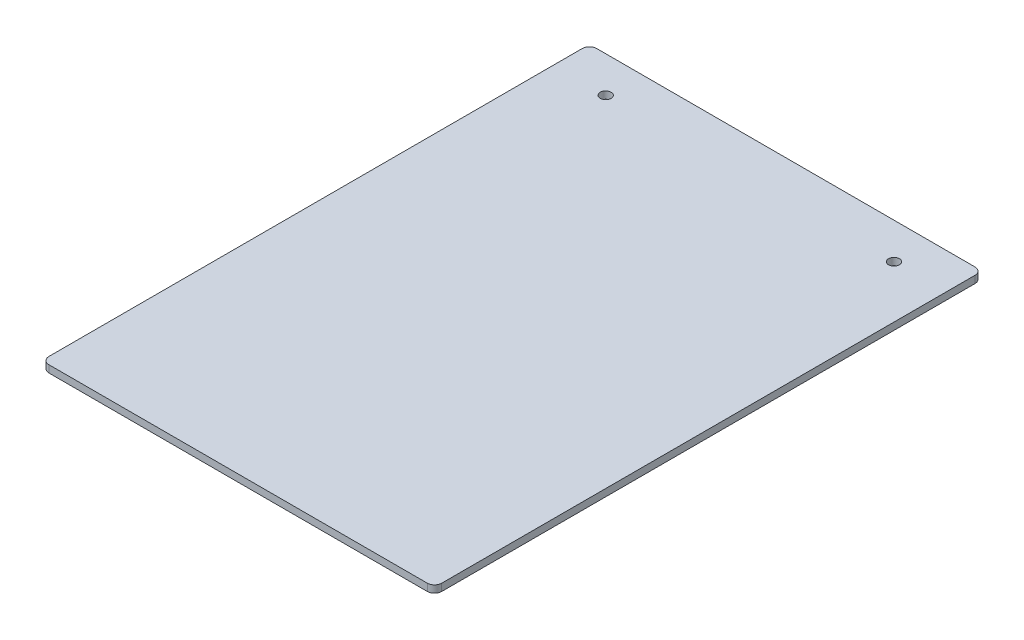
ISO-10303-21;
HEADER;
FILE_DESCRIPTION(('STEP AP214'),'2;1');
FILE_NAME('part.step','',(''),(''),'','','');
FILE_SCHEMA(('AUTOMOTIVE_DESIGN { 1 0 10303 214 1 1 1 1 }'));
ENDSEC;
DATA;
#1=APPLICATION_CONTEXT('core data for automotive mechanical design processes');
#2=APPLICATION_PROTOCOL_DEFINITION('international standard','automotive_design',2000,#1);
#3=PRODUCT_CONTEXT('',#1,'mechanical');
#4=PRODUCT('Part','Part','',(#3));
#5=PRODUCT_RELATED_PRODUCT_CATEGORY('part','',(#4));
#6=PRODUCT_DEFINITION_FORMATION('','',#4);
#7=PRODUCT_DEFINITION_CONTEXT('part definition',#1,'design');
#8=PRODUCT_DEFINITION('design','',#6,#7);
#9=PRODUCT_DEFINITION_SHAPE('','',#8);
#10=(LENGTH_UNIT() NAMED_UNIT(*) SI_UNIT(.MILLI.,.METRE.));
#11=(NAMED_UNIT(*) PLANE_ANGLE_UNIT() SI_UNIT($,.RADIAN.));
#12=(NAMED_UNIT(*) SI_UNIT($,.STERADIAN.) SOLID_ANGLE_UNIT());
#13=UNCERTAINTY_MEASURE_WITH_UNIT(LENGTH_MEASURE(1.E-05),#10,'distance_accuracy_value','');
#14=(GEOMETRIC_REPRESENTATION_CONTEXT(3) GLOBAL_UNCERTAINTY_ASSIGNED_CONTEXT((#13)) GLOBAL_UNIT_ASSIGNED_CONTEXT((#10,
#11,#12)) REPRESENTATION_CONTEXT('',''));
#15=CARTESIAN_POINT('',(0.,0.,0.));
#16=DIRECTION('',(0.,0.,1.));
#17=DIRECTION('',(1.,0.,0.));
#18=AXIS2_PLACEMENT_3D('',#15,#16,#17);
#19=CARTESIAN_POINT('',(173.0375,6.35,241.3));
#20=DIRECTION('',(-1.,0.,0.));
#21=DIRECTION('',(0.,0.,1.));
#22=AXIS2_PLACEMENT_3D('',#19,#20,#21);
#23=PLANE('',#22);
#24=DIRECTION('',(0.,0.,-1.));
#25=VECTOR('',#24,1.);
#26=CARTESIAN_POINT('',(173.0375,0.,241.3));
#27=LINE('',#26,#25);
#28=CARTESIAN_POINT('',(173.0375,0.,234.95));
#29=VERTEX_POINT('',#28);
#30=CARTESIAN_POINT('',(173.0375,0.,-234.95));
#31=VERTEX_POINT('',#30);
#32=EDGE_CURVE('E127',#29,#31,#27,.T.);
#33=ORIENTED_EDGE('',*,*,#32,.T.);
#34=DIRECTION('',(0.,-1.,0.));
#35=VECTOR('',#34,1.);
#36=CARTESIAN_POINT('',(173.0375,6.35,-234.95));
#37=LINE('',#36,#35);
#38=CARTESIAN_POINT('',(173.0375,6.35,-234.95));
#39=VERTEX_POINT('',#38);
#40=EDGE_CURVE('E105',#31,#39,#37,.F.);
#41=ORIENTED_EDGE('',*,*,#40,.T.);
#42=DIRECTION('',(0.,0.,-1.));
#43=VECTOR('',#42,1.);
#44=CARTESIAN_POINT('',(173.0375,6.35,241.3));
#45=LINE('',#44,#43);
#46=CARTESIAN_POINT('',(173.0375,6.35,234.95));
#47=VERTEX_POINT('',#46);
#48=EDGE_CURVE('E137',#47,#39,#45,.T.);
#49=ORIENTED_EDGE('',*,*,#48,.F.);
#50=DIRECTION('',(0.,-1.,0.));
#51=VECTOR('',#50,1.);
#52=CARTESIAN_POINT('',(173.0375,6.35,234.95));
#53=LINE('',#52,#51);
#54=EDGE_CURVE('E110',#47,#29,#53,.T.);
#55=ORIENTED_EDGE('',*,*,#54,.T.);
#56=EDGE_LOOP('',(#33,#41,#49,#55));
#57=FACE_BOUND('',#56,.T.);
#58=ADVANCED_FACE('F34',(#57),#23,.F.);
#59=CARTESIAN_POINT('',(-173.0375,6.35,-241.3));
#60=DIRECTION('',(0.,0.,1.));
#61=DIRECTION('',(1.,0.,0.));
#62=AXIS2_PLACEMENT_3D('',#59,#60,#61);
#63=PLANE('',#62);
#64=DIRECTION('',(-1.,0.,0.));
#65=VECTOR('',#64,1.);
#66=CARTESIAN_POINT('',(-173.0375,6.35,-241.3));
#67=LINE('',#66,#65);
#68=CARTESIAN_POINT('',(166.6875,6.35,-241.3));
#69=VERTEX_POINT('',#68);
#70=CARTESIAN_POINT('',(-166.6875,6.35,-241.3));
#71=VERTEX_POINT('',#70);
#72=EDGE_CURVE('E120',#69,#71,#67,.T.);
#73=ORIENTED_EDGE('',*,*,#72,.F.);
#74=DIRECTION('',(0.,-1.,0.));
#75=VECTOR('',#74,1.);
#76=CARTESIAN_POINT('',(166.6875,6.35,-241.3));
#77=LINE('',#76,#75);
#78=CARTESIAN_POINT('',(166.6875,0.,-241.3));
#79=VERTEX_POINT('',#78);
#80=EDGE_CURVE('E104',#69,#79,#77,.T.);
#81=ORIENTED_EDGE('',*,*,#80,.T.);
#82=DIRECTION('',(-1.,0.,0.));
#83=VECTOR('',#82,1.);
#84=CARTESIAN_POINT('',(-173.0375,0.,-241.3));
#85=LINE('',#84,#83);
#86=CARTESIAN_POINT('',(-166.6875,0.,-241.3));
#87=VERTEX_POINT('',#86);
#88=EDGE_CURVE('E117',#79,#87,#85,.T.);
#89=ORIENTED_EDGE('',*,*,#88,.T.);
#90=DIRECTION('',(0.,-1.,0.));
#91=VECTOR('',#90,1.);
#92=CARTESIAN_POINT('',(-166.6875,6.35,-241.3));
#93=LINE('',#92,#91);
#94=EDGE_CURVE('E122',#87,#71,#93,.F.);
#95=ORIENTED_EDGE('',*,*,#94,.T.);
#96=EDGE_LOOP('',(#73,#81,#89,#95));
#97=FACE_BOUND('',#96,.T.);
#98=ADVANCED_FACE('F116',(#97),#63,.F.);
#99=CARTESIAN_POINT('',(-173.0375,6.35,241.3));
#100=DIRECTION('',(1.,0.,0.));
#101=DIRECTION('',(0.,0.,-1.));
#102=AXIS2_PLACEMENT_3D('',#99,#100,#101);
#103=PLANE('',#102);
#104=DIRECTION('',(0.,0.,1.));
#105=VECTOR('',#104,1.);
#106=CARTESIAN_POINT('',(-173.0375,6.35,241.3));
#107=LINE('',#106,#105);
#108=CARTESIAN_POINT('',(-173.0375,6.35,-234.95));
#109=VERTEX_POINT('',#108);
#110=CARTESIAN_POINT('',(-173.0375,6.35,234.95));
#111=VERTEX_POINT('',#110);
#112=EDGE_CURVE('E163',#109,#111,#107,.T.);
#113=ORIENTED_EDGE('',*,*,#112,.F.);
#114=DIRECTION('',(0.,-1.,0.));
#115=VECTOR('',#114,1.);
#116=CARTESIAN_POINT('',(-173.0375,6.35,-234.95));
#117=LINE('',#116,#115);
#118=CARTESIAN_POINT('',(-173.0375,0.,-234.95));
#119=VERTEX_POINT('',#118);
#120=EDGE_CURVE('E156',#109,#119,#117,.T.);
#121=ORIENTED_EDGE('',*,*,#120,.T.);
#122=DIRECTION('',(0.,0.,1.));
#123=VECTOR('',#122,1.);
#124=CARTESIAN_POINT('',(-173.0375,0.,241.3));
#125=LINE('',#124,#123);
#126=CARTESIAN_POINT('',(-173.0375,0.,234.95));
#127=VERTEX_POINT('',#126);
#128=EDGE_CURVE('E126',#119,#127,#125,.T.);
#129=ORIENTED_EDGE('',*,*,#128,.T.);
#130=DIRECTION('',(0.,-1.,0.));
#131=VECTOR('',#130,1.);
#132=CARTESIAN_POINT('',(-173.0375,6.35,234.95));
#133=LINE('',#132,#131);
#134=EDGE_CURVE('E154',#127,#111,#133,.F.);
#135=ORIENTED_EDGE('',*,*,#134,.T.);
#136=EDGE_LOOP('',(#113,#121,#129,#135));
#137=FACE_BOUND('',#136,.T.);
#138=ADVANCED_FACE('F161',(#137),#103,.F.);
#139=CARTESIAN_POINT('',(-173.0375,6.35,241.3));
#140=DIRECTION('',(0.,0.,-1.));
#141=DIRECTION('',(-1.,0.,0.));
#142=AXIS2_PLACEMENT_3D('',#139,#140,#141);
#143=PLANE('',#142);
#144=DIRECTION('',(1.,0.,0.));
#145=VECTOR('',#144,1.);
#146=CARTESIAN_POINT('',(-173.0375,6.35,241.3));
#147=LINE('',#146,#145);
#148=CARTESIAN_POINT('',(-166.6875,6.35,241.3));
#149=VERTEX_POINT('',#148);
#150=CARTESIAN_POINT('',(166.6875,6.35,241.3));
#151=VERTEX_POINT('',#150);
#152=EDGE_CURVE('E138',#149,#151,#147,.T.);
#153=ORIENTED_EDGE('',*,*,#152,.F.);
#154=DIRECTION('',(0.,-1.,0.));
#155=VECTOR('',#154,1.);
#156=CARTESIAN_POINT('',(-166.6875,6.35,241.3));
#157=LINE('',#156,#155);
#158=CARTESIAN_POINT('',(-166.6875,0.,241.3));
#159=VERTEX_POINT('',#158);
#160=EDGE_CURVE('E11',#149,#159,#157,.T.);
#161=ORIENTED_EDGE('',*,*,#160,.T.);
#162=DIRECTION('',(1.,0.,0.));
#163=VECTOR('',#162,1.);
#164=CARTESIAN_POINT('',(-173.0375,0.,241.3));
#165=LINE('',#164,#163);
#166=CARTESIAN_POINT('',(166.6875,0.,241.3));
#167=VERTEX_POINT('',#166);
#168=EDGE_CURVE('E130',#159,#167,#165,.T.);
#169=ORIENTED_EDGE('',*,*,#168,.T.);
#170=DIRECTION('',(0.,-1.,0.));
#171=VECTOR('',#170,1.);
#172=CARTESIAN_POINT('',(166.6875,6.35,241.3));
#173=LINE('',#172,#171);
#174=EDGE_CURVE('E42',#167,#151,#173,.F.);
#175=ORIENTED_EDGE('',*,*,#174,.T.);
#176=EDGE_LOOP('',(#153,#161,#169,#175));
#177=FACE_BOUND('',#176,.T.);
#178=ADVANCED_FACE('F170',(#177),#143,.F.);
#179=CARTESIAN_POINT('',(0.,6.35,0.));
#180=DIRECTION('',(0.,-1.,0.));
#181=DIRECTION('',(0.,0.,-1.));
#182=AXIS2_PLACEMENT_3D('',#179,#180,#181);
#183=PLANE('',#182);
#184=CARTESIAN_POINT('',(-127.,6.35,-209.55));
#185=DIRECTION('',(0.,1.,0.));
#186=DIRECTION('',(0.,0.,1.));
#187=AXIS2_PLACEMENT_3D('',#184,#185,#186);
#188=CIRCLE('',#187,4.76249999999999);
#189=CARTESIAN_POINT('',(-127.,6.35,-204.7875));
#190=VERTEX_POINT('',#189);
#191=EDGE_CURVE('E185',#190,#190,#188,.T.);
#192=ORIENTED_EDGE('',*,*,#191,.F.);
#193=EDGE_LOOP('',(#192));
#194=FACE_BOUND('',#193,.T.);
#195=CARTESIAN_POINT('',(127.,6.35,-209.55));
#196=DIRECTION('',(0.,1.,0.));
#197=DIRECTION('',(0.,0.,1.));
#198=AXIS2_PLACEMENT_3D('',#195,#196,#197);
#199=CIRCLE('',#198,4.7625);
#200=CARTESIAN_POINT('',(127.,6.35,-204.7875));
#201=VERTEX_POINT('',#200);
#202=EDGE_CURVE('E179',#201,#201,#199,.T.);
#203=ORIENTED_EDGE('',*,*,#202,.F.);
#204=EDGE_LOOP('',(#203));
#205=FACE_BOUND('',#204,.T.);
#206=ORIENTED_EDGE('',*,*,#48,.T.);
#207=CARTESIAN_POINT('',(166.6875,6.35,-234.95));
#208=DIRECTION('',(0.,-1.,0.));
#209=DIRECTION('',(0.,0.,-1.));
#210=AXIS2_PLACEMENT_3D('',#207,#208,#209);
#211=CIRCLE('',#210,6.35);
#212=EDGE_CURVE('E152',#39,#69,#211,.F.);
#213=ORIENTED_EDGE('',*,*,#212,.T.);
#214=ORIENTED_EDGE('',*,*,#72,.T.);
#215=CARTESIAN_POINT('',(-166.6875,6.35,-234.95));
#216=DIRECTION('',(0.,-1.,0.));
#217=DIRECTION('',(0.,0.,-1.));
#218=AXIS2_PLACEMENT_3D('',#215,#216,#217);
#219=CIRCLE('',#218,6.35);
#220=EDGE_CURVE('E150',#71,#109,#219,.F.);
#221=ORIENTED_EDGE('',*,*,#220,.T.);
#222=ORIENTED_EDGE('',*,*,#112,.T.);
#223=CARTESIAN_POINT('',(-166.6875,6.35,234.95));
#224=DIRECTION('',(0.,-1.,0.));
#225=DIRECTION('',(0.,0.,-1.));
#226=AXIS2_PLACEMENT_3D('',#223,#224,#225);
#227=CIRCLE('',#226,6.35);
#228=EDGE_CURVE('E55',#111,#149,#227,.F.);
#229=ORIENTED_EDGE('',*,*,#228,.T.);
#230=ORIENTED_EDGE('',*,*,#152,.T.);
#231=CARTESIAN_POINT('',(166.6875,6.35,234.95));
#232=DIRECTION('',(0.,-1.,0.));
#233=DIRECTION('',(0.,0.,-1.));
#234=AXIS2_PLACEMENT_3D('',#231,#232,#233);
#235=CIRCLE('',#234,6.35);
#236=EDGE_CURVE('E147',#151,#47,#235,.F.);
#237=ORIENTED_EDGE('',*,*,#236,.T.);
#238=EDGE_LOOP('',(#206,#213,#214,#221,#222,#229,#230,#237));
#239=FACE_BOUND('',#238,.T.);
#240=ADVANCED_FACE('F191',(#194,#205,#239),#183,.F.);
#241=CARTESIAN_POINT('',(0.,0.,0.));
#242=DIRECTION('',(0.,-1.,0.));
#243=DIRECTION('',(0.,0.,-1.));
#244=AXIS2_PLACEMENT_3D('',#241,#242,#243);
#245=PLANE('',#244);
#246=CARTESIAN_POINT('',(-127.,0.,-209.55));
#247=DIRECTION('',(0.,1.,0.));
#248=DIRECTION('',(0.,0.,1.));
#249=AXIS2_PLACEMENT_3D('',#246,#247,#248);
#250=CIRCLE('',#249,4.76249999999999);
#251=CARTESIAN_POINT('',(-127.,0.,-204.7875));
#252=VERTEX_POINT('',#251);
#253=EDGE_CURVE('E182',#252,#252,#250,.T.);
#254=ORIENTED_EDGE('',*,*,#253,.T.);
#255=EDGE_LOOP('',(#254));
#256=FACE_BOUND('',#255,.T.);
#257=CARTESIAN_POINT('',(127.,0.,-209.55));
#258=DIRECTION('',(0.,1.,0.));
#259=DIRECTION('',(0.,0.,1.));
#260=AXIS2_PLACEMENT_3D('',#257,#258,#259);
#261=CIRCLE('',#260,4.7625);
#262=CARTESIAN_POINT('',(127.,0.,-204.7875));
#263=VERTEX_POINT('',#262);
#264=EDGE_CURVE('E132',#263,#263,#261,.T.);
#265=ORIENTED_EDGE('',*,*,#264,.T.);
#266=EDGE_LOOP('',(#265));
#267=FACE_BOUND('',#266,.T.);
#268=ORIENTED_EDGE('',*,*,#88,.F.);
#269=CARTESIAN_POINT('',(166.6875,0.,-234.95));
#270=DIRECTION('',(0.,-1.,0.));
#271=DIRECTION('',(0.,0.,-1.));
#272=AXIS2_PLACEMENT_3D('',#269,#270,#271);
#273=CIRCLE('',#272,6.35);
#274=EDGE_CURVE('E100',#79,#31,#273,.T.);
#275=ORIENTED_EDGE('',*,*,#274,.T.);
#276=ORIENTED_EDGE('',*,*,#32,.F.);
#277=CARTESIAN_POINT('',(166.6875,0.,234.95));
#278=DIRECTION('',(0.,-1.,0.));
#279=DIRECTION('',(0.,0.,-1.));
#280=AXIS2_PLACEMENT_3D('',#277,#278,#279);
#281=CIRCLE('',#280,6.35);
#282=EDGE_CURVE('E121',#29,#167,#281,.T.);
#283=ORIENTED_EDGE('',*,*,#282,.T.);
#284=ORIENTED_EDGE('',*,*,#168,.F.);
#285=CARTESIAN_POINT('',(-166.6875,0.,234.95));
#286=DIRECTION('',(0.,-1.,0.));
#287=DIRECTION('',(0.,0.,-1.));
#288=AXIS2_PLACEMENT_3D('',#285,#286,#287);
#289=CIRCLE('',#288,6.35);
#290=EDGE_CURVE('E141',#159,#127,#289,.T.);
#291=ORIENTED_EDGE('',*,*,#290,.T.);
#292=ORIENTED_EDGE('',*,*,#128,.F.);
#293=CARTESIAN_POINT('',(-166.6875,0.,-234.95));
#294=DIRECTION('',(0.,-1.,0.));
#295=DIRECTION('',(0.,0.,-1.));
#296=AXIS2_PLACEMENT_3D('',#293,#294,#295);
#297=CIRCLE('',#296,6.35);
#298=EDGE_CURVE('E111',#119,#87,#297,.T.);
#299=ORIENTED_EDGE('',*,*,#298,.T.);
#300=EDGE_LOOP('',(#268,#275,#276,#283,#284,#291,#292,#299));
#301=FACE_BOUND('',#300,.T.);
#302=ADVANCED_FACE('F124',(#256,#267,#301),#245,.T.);
#303=CARTESIAN_POINT('',(166.6875,6.35,-234.95));
#304=DIRECTION('',(0.,-1.,0.));
#305=DIRECTION('',(0.,0.,-1.));
#306=AXIS2_PLACEMENT_3D('',#303,#304,#305);
#307=CYLINDRICAL_SURFACE('',#306,6.35);
#308=ORIENTED_EDGE('',*,*,#212,.F.);
#309=ORIENTED_EDGE('',*,*,#40,.F.);
#310=ORIENTED_EDGE('',*,*,#274,.F.);
#311=ORIENTED_EDGE('',*,*,#80,.F.);
#312=EDGE_LOOP('',(#308,#309,#310,#311));
#313=FACE_BOUND('',#312,.T.);
#314=ADVANCED_FACE('F103',(#313),#307,.T.);
#315=CARTESIAN_POINT('',(-166.6875,6.35,-234.95));
#316=DIRECTION('',(0.,-1.,0.));
#317=DIRECTION('',(0.,0.,-1.));
#318=AXIS2_PLACEMENT_3D('',#315,#316,#317);
#319=CYLINDRICAL_SURFACE('',#318,6.35);
#320=ORIENTED_EDGE('',*,*,#220,.F.);
#321=ORIENTED_EDGE('',*,*,#94,.F.);
#322=ORIENTED_EDGE('',*,*,#298,.F.);
#323=ORIENTED_EDGE('',*,*,#120,.F.);
#324=EDGE_LOOP('',(#320,#321,#322,#323));
#325=FACE_BOUND('',#324,.T.);
#326=ADVANCED_FACE('F208',(#325),#319,.T.);
#327=CARTESIAN_POINT('',(-166.6875,6.35,234.95));
#328=DIRECTION('',(0.,-1.,0.));
#329=DIRECTION('',(0.,0.,-1.));
#330=AXIS2_PLACEMENT_3D('',#327,#328,#329);
#331=CYLINDRICAL_SURFACE('',#330,6.35);
#332=ORIENTED_EDGE('',*,*,#228,.F.);
#333=ORIENTED_EDGE('',*,*,#134,.F.);
#334=ORIENTED_EDGE('',*,*,#290,.F.);
#335=ORIENTED_EDGE('',*,*,#160,.F.);
#336=EDGE_LOOP('',(#332,#333,#334,#335));
#337=FACE_BOUND('',#336,.T.);
#338=ADVANCED_FACE('F169',(#337),#331,.T.);
#339=CARTESIAN_POINT('',(166.6875,6.35,234.95));
#340=DIRECTION('',(0.,-1.,0.));
#341=DIRECTION('',(0.,0.,-1.));
#342=AXIS2_PLACEMENT_3D('',#339,#340,#341);
#343=CYLINDRICAL_SURFACE('',#342,6.35);
#344=ORIENTED_EDGE('',*,*,#236,.F.);
#345=ORIENTED_EDGE('',*,*,#174,.F.);
#346=ORIENTED_EDGE('',*,*,#282,.F.);
#347=ORIENTED_EDGE('',*,*,#54,.F.);
#348=EDGE_LOOP('',(#344,#345,#346,#347));
#349=FACE_BOUND('',#348,.T.);
#350=ADVANCED_FACE('F36',(#349),#343,.T.);
#351=CARTESIAN_POINT('',(127.,6.35,-209.55));
#352=DIRECTION('',(0.,1.,0.));
#353=DIRECTION('',(0.,0.,1.));
#354=AXIS2_PLACEMENT_3D('',#351,#352,#353);
#355=CYLINDRICAL_SURFACE('',#354,4.7625);
#356=ORIENTED_EDGE('',*,*,#264,.F.);
#357=EDGE_LOOP('',(#356));
#358=FACE_BOUND('',#357,.T.);
#359=ORIENTED_EDGE('',*,*,#202,.T.);
#360=EDGE_LOOP('',(#359));
#361=FACE_BOUND('',#360,.T.);
#362=ADVANCED_FACE('F201',(#358,#361),#355,.F.);
#363=CARTESIAN_POINT('',(-127.,6.35,-209.55));
#364=DIRECTION('',(0.,1.,0.));
#365=DIRECTION('',(0.,0.,1.));
#366=AXIS2_PLACEMENT_3D('',#363,#364,#365);
#367=CYLINDRICAL_SURFACE('',#366,4.76249999999999);
#368=ORIENTED_EDGE('',*,*,#253,.F.);
#369=EDGE_LOOP('',(#368));
#370=FACE_BOUND('',#369,.T.);
#371=ORIENTED_EDGE('',*,*,#191,.T.);
#372=EDGE_LOOP('',(#371));
#373=FACE_BOUND('',#372,.T.);
#374=ADVANCED_FACE('F189',(#370,#373),#367,.F.);
#375=CLOSED_SHELL('',(#58,#98,#138,#178,#240,#302,#314,#326,#338,#350,#362,#374));
#376=MANIFOLD_SOLID_BREP('B2',#375);
#377=ADVANCED_BREP_SHAPE_REPRESENTATION('',(#18,#376),#14);
#378=SHAPE_DEFINITION_REPRESENTATION(#9,#377);
ENDSEC;
END-ISO-10303-21;
